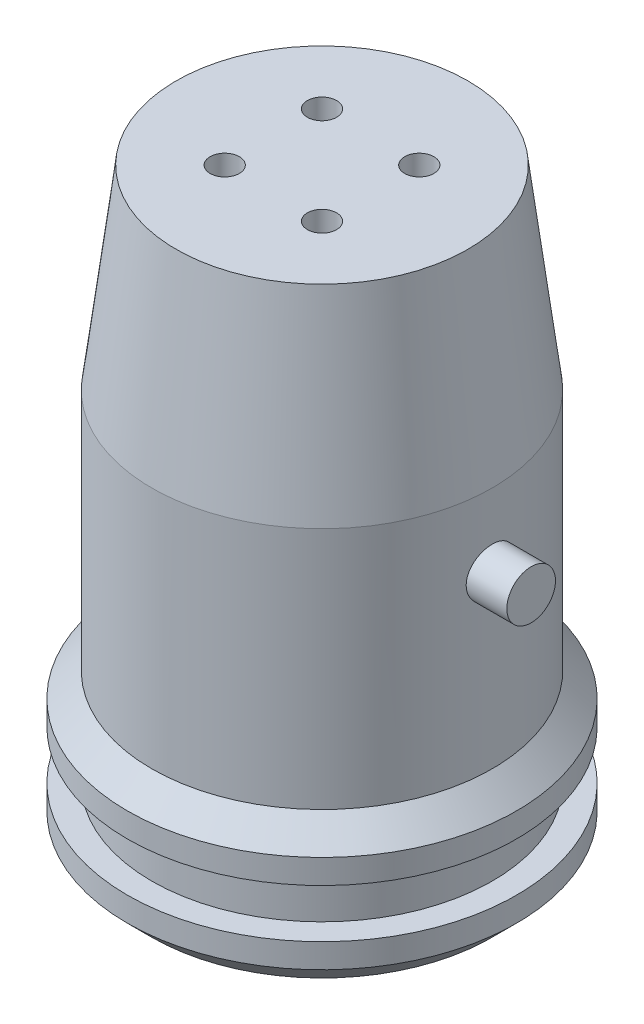
ISO-10303-21;
HEADER;
FILE_DESCRIPTION(('STEP AP214'),'2;1');
FILE_NAME('part.step','',(''),(''),'','','');
FILE_SCHEMA(('AUTOMOTIVE_DESIGN { 1 0 10303 214 1 1 1 1 }'));
ENDSEC;
DATA;
#1=APPLICATION_CONTEXT('core data for automotive mechanical design processes');
#2=APPLICATION_PROTOCOL_DEFINITION('international standard','automotive_design',2000,#1);
#3=PRODUCT_CONTEXT('',#1,'mechanical');
#4=PRODUCT('Part','Part','',(#3));
#5=PRODUCT_RELATED_PRODUCT_CATEGORY('part','',(#4));
#6=PRODUCT_DEFINITION_FORMATION('','',#4);
#7=PRODUCT_DEFINITION_CONTEXT('part definition',#1,'design');
#8=PRODUCT_DEFINITION('design','',#6,#7);
#9=PRODUCT_DEFINITION_SHAPE('','',#8);
#10=(LENGTH_UNIT() NAMED_UNIT(*) SI_UNIT(.MILLI.,.METRE.));
#11=(NAMED_UNIT(*) PLANE_ANGLE_UNIT() SI_UNIT($,.RADIAN.));
#12=(NAMED_UNIT(*) SI_UNIT($,.STERADIAN.) SOLID_ANGLE_UNIT());
#13=UNCERTAINTY_MEASURE_WITH_UNIT(LENGTH_MEASURE(1.E-05),#10,'distance_accuracy_value','');
#14=(GEOMETRIC_REPRESENTATION_CONTEXT(3) GLOBAL_UNCERTAINTY_ASSIGNED_CONTEXT((#13)) GLOBAL_UNIT_ASSIGNED_CONTEXT((#10,
#11,#12)) REPRESENTATION_CONTEXT('',''));
#15=CARTESIAN_POINT('',(0.,0.,0.));
#16=DIRECTION('',(0.,0.,1.));
#17=DIRECTION('',(1.,0.,0.));
#18=AXIS2_PLACEMENT_3D('',#15,#16,#17);
#19=CARTESIAN_POINT('',(0.,0.,0.));
#20=DIRECTION('',(0.,-1.,0.));
#21=DIRECTION('',(0.,0.,-1.));
#22=AXIS2_PLACEMENT_3D('',#19,#20,#21);
#23=CYLINDRICAL_SURFACE('',#22,17.5);
#24=CARTESIAN_POINT('',(0.,5.,0.));
#25=DIRECTION('',(0.,1.,0.));
#26=DIRECTION('',(0.,0.,1.));
#27=AXIS2_PLACEMENT_3D('',#24,#25,#26);
#28=CIRCLE('',#27,17.5);
#29=CARTESIAN_POINT('',(0.,5.,17.5));
#30=VERTEX_POINT('',#29);
#31=EDGE_CURVE('E77',#30,#30,#28,.F.);
#32=ORIENTED_EDGE('',*,*,#31,.F.);
#33=EDGE_LOOP('',(#32));
#34=FACE_BOUND('',#33,.T.);
#35=CARTESIAN_POINT('',(0.,10.,0.));
#36=DIRECTION('',(0.,1.,0.));
#37=DIRECTION('',(0.,0.,1.));
#38=AXIS2_PLACEMENT_3D('',#35,#36,#37);
#39=CIRCLE('',#38,17.5);
#40=CARTESIAN_POINT('',(0.,10.,17.5));
#41=VERTEX_POINT('',#40);
#42=EDGE_CURVE('E241',#41,#41,#39,.T.);
#43=ORIENTED_EDGE('',*,*,#42,.F.);
#44=EDGE_LOOP('',(#43));
#45=FACE_BOUND('',#44,.T.);
#46=ADVANCED_FACE('F33',(#34,#45),#23,.T.);
#47=CARTESIAN_POINT('',(0.,0.,0.));
#48=DIRECTION('',(0.,-1.,0.));
#49=DIRECTION('',(0.,0.,-1.));
#50=AXIS2_PLACEMENT_3D('',#47,#48,#49);
#51=CYLINDRICAL_SURFACE('',#50,15.);
#52=DIRECTION('',(0.,-1.,0.));
#53=VECTOR('',#52,1.);
#54=CARTESIAN_POINT('',(-10.,0.,-11.1803398874989));
#55=LINE('',#54,#53);
#56=CARTESIAN_POINT('',(-10.,37.5,-11.1803398874989));
#57=VERTEX_POINT('',#56);
#58=CARTESIAN_POINT('',(-10.,27.5,-11.1803398874989));
#59=VERTEX_POINT('',#58);
#60=EDGE_CURVE('E84',#57,#59,#55,.T.);
#61=ORIENTED_EDGE('',*,*,#60,.F.);
#62=CARTESIAN_POINT('',(0.,37.5,0.));
#63=DIRECTION('',(0.,1.,0.));
#64=DIRECTION('',(-1.,0.,0.));
#65=AXIS2_PLACEMENT_3D('',#62,#63,#64);
#66=CIRCLE('',#65,15.);
#67=CARTESIAN_POINT('',(9.99999999999999,37.5,-11.180339887499));
#68=VERTEX_POINT('',#67);
#69=EDGE_CURVE('E263',#68,#57,#66,.T.);
#70=ORIENTED_EDGE('',*,*,#69,.F.);
#71=DIRECTION('',(0.,-1.,0.));
#72=VECTOR('',#71,1.);
#73=CARTESIAN_POINT('',(9.99999999999998,0.,-11.180339887499));
#74=LINE('',#73,#72);
#75=CARTESIAN_POINT('',(9.99999999999999,27.5,-11.180339887499));
#76=VERTEX_POINT('',#75);
#77=EDGE_CURVE('E265',#76,#68,#74,.F.);
#78=ORIENTED_EDGE('',*,*,#77,.F.);
#79=CARTESIAN_POINT('',(0.,27.5,0.));
#80=DIRECTION('',(0.,-1.,0.));
#81=DIRECTION('',(1.,0.,0.));
#82=AXIS2_PLACEMENT_3D('',#79,#80,#81);
#83=CIRCLE('',#82,15.);
#84=EDGE_CURVE('E267',#59,#76,#83,.T.);
#85=ORIENTED_EDGE('',*,*,#84,.F.);
#86=EDGE_LOOP('',(#61,#70,#78,#85));
#87=FACE_BOUND('',#86,.T.);
#88=CARTESIAN_POINT('',(0.,40.,0.));
#89=DIRECTION('',(0.,-1.,0.));
#90=DIRECTION('',(0.,0.,-1.));
#91=AXIS2_PLACEMENT_3D('',#88,#89,#90);
#92=CIRCLE('',#91,15.);
#93=CARTESIAN_POINT('',(0.,40.,-15.));
#94=VERTEX_POINT('',#93);
#95=EDGE_CURVE('E131',#94,#94,#92,.T.);
#96=ORIENTED_EDGE('',*,*,#95,.F.);
#97=EDGE_LOOP('',(#96));
#98=FACE_BOUND('',#97,.T.);
#99=CARTESIAN_POINT('',(0.,0.,0.));
#100=DIRECTION('',(0.,-1.,0.));
#101=DIRECTION('',(0.,0.,-1.));
#102=AXIS2_PLACEMENT_3D('',#99,#100,#101);
#103=CIRCLE('',#102,15.);
#104=CARTESIAN_POINT('',(0.,0.,-15.));
#105=VERTEX_POINT('',#104);
#106=EDGE_CURVE('E96',#105,#105,#103,.T.);
#107=ORIENTED_EDGE('',*,*,#106,.T.);
#108=EDGE_LOOP('',(#107));
#109=FACE_BOUND('',#108,.T.);
#110=CARTESIAN_POINT('',(14.790199457749,32.5,2.5));
#111=CARTESIAN_POINT('',(14.790201973666,32.3606242518382,2.49999439841983));
#112=CARTESIAN_POINT('',(14.7921909238523,32.2211723939285,2.48830516902829));
#113=CARTESIAN_POINT('',(14.7999245720004,31.9461814567368,2.44187742806638));
#114=CARTESIAN_POINT('',(14.8056727334637,31.8106461062419,2.40711766030861));
#115=CARTESIAN_POINT('',(14.8202560936731,31.5475077166584,2.3156295436705));
#116=CARTESIAN_POINT('',(14.8290887118401,31.4198981513378,2.25891955493199));
#117=CARTESIAN_POINT('',(14.8488427210228,31.1760190452822,2.12518649688947));
#118=CARTESIAN_POINT('',(14.8597638769423,31.0597482304227,2.04816571350133));
#119=CARTESIAN_POINT('',(14.8825847115588,30.8406871502554,1.87518752696655));
#120=CARTESIAN_POINT('',(14.8944921732794,30.7380248686138,1.77906904893234));
#121=CARTESIAN_POINT('',(14.9178748066858,30.5502066931382,1.57097200469528));
#122=CARTESIAN_POINT('',(14.9293499527174,30.4650518368846,1.45899249914998));
#123=CARTESIAN_POINT('',(14.9506573698271,30.3141854327807,1.22152286994836));
#124=CARTESIAN_POINT('',(14.9604794243234,30.2485929922682,1.09595608145671));
#125=CARTESIAN_POINT('',(14.9772873695709,30.1394789294694,0.835395621723871));
#126=CARTESIAN_POINT('',(14.9842734447266,30.0959558721151,0.700402564078191));
#127=CARTESIAN_POINT('',(14.994567347244,30.0326074650161,0.426143726344245));
#128=CARTESIAN_POINT('',(14.9979085311091,30.0125670839953,0.286928886679273));
#129=CARTESIAN_POINT('',(15.0006507934278,29.9960842458474,0.00707528552579785));
#130=CARTESIAN_POINT('',(15.0000521396931,29.9996401847528,-0.133563378528898));
#131=CARTESIAN_POINT('',(14.9950085843139,30.0300813515282,-0.410802185078876));
#132=CARTESIAN_POINT('',(14.990601836924,30.0567351634091,-0.547428530700141));
#133=CARTESIAN_POINT('',(14.9784797877164,30.1322510742465,-0.814241979611792));
#134=CARTESIAN_POINT('',(14.9707643851321,30.1811138495895,-0.944428886651505));
#135=CARTESIAN_POINT('',(14.9528269851196,30.2998906403153,-1.19535614778265));
#136=CARTESIAN_POINT('',(14.9425936732688,30.3699000120824,-1.31605052301905));
#137=CARTESIAN_POINT('',(14.920757380715,30.528912822635,-1.54406552984664));
#138=CARTESIAN_POINT('',(14.9091542891913,30.6179177987108,-1.65138507791588));
#139=CARTESIAN_POINT('',(14.885702682326,30.8136788066193,-1.85097127344667));
#140=CARTESIAN_POINT('',(14.8738528973104,30.920637094901,-1.94303950225321));
#141=CARTESIAN_POINT('',(14.8513795978481,31.1485870902158,-2.10795458844807));
#142=CARTESIAN_POINT('',(14.8407560947132,31.2695789266828,-2.18080126853242));
#143=CARTESIAN_POINT('',(14.8219375456182,31.5223916418775,-2.30524443448829));
#144=CARTESIAN_POINT('',(14.813745233026,31.6542244980921,-2.35681702727925));
#145=CARTESIAN_POINT('',(14.8007618868988,31.9248490723075,-2.43702987081562));
#146=CARTESIAN_POINT('',(14.7959705538832,32.0636401764324,-2.46567214076796));
#147=CARTESIAN_POINT('',(14.7903895942212,32.3424661561621,-2.49893188487927));
#148=CARTESIAN_POINT('',(14.7895528575867,32.4824663797021,-2.50383220791244));
#149=CARTESIAN_POINT('',(14.7918503478236,32.7612866716908,-2.49022270268246));
#150=CARTESIAN_POINT('',(14.7949844213185,32.900106785514,-2.47171377862467));
#151=CARTESIAN_POINT('',(14.8048268745502,33.1717277591909,-2.4120523349281));
#152=CARTESIAN_POINT('',(14.8115125191835,33.304561139878,-2.37104379064639));
#153=CARTESIAN_POINT('',(14.827685730055,33.5614701662795,-2.26769819019228));
#154=CARTESIAN_POINT('',(14.8371734639058,33.6855452875509,-2.20535985810094));
#155=CARTESIAN_POINT('',(14.8579912839739,33.9226745944061,-2.06045667322923));
#156=CARTESIAN_POINT('',(14.8693375560035,34.0356165727561,-1.97771056415937));
#157=CARTESIAN_POINT('',(14.8925466667987,34.246113532695,-1.79458946570799));
#158=CARTESIAN_POINT('',(14.9044095418533,34.3436674311097,-1.69421323638405));
#159=CARTESIAN_POINT('',(14.9274642211826,34.5216518927287,-1.47742807032881));
#160=CARTESIAN_POINT('',(14.9386477634467,34.6018938262845,-1.3608632533862));
#161=CARTESIAN_POINT('',(14.9589511243294,34.7416553270049,-1.11574344794933));
#162=CARTESIAN_POINT('',(14.9680710096998,34.8011755644739,-0.98718884747063));
#163=CARTESIAN_POINT('',(14.9831835816958,34.8975105839549,-0.722299051501331));
#164=CARTESIAN_POINT('',(14.9891898456762,34.9344240757349,-0.586000562602614));
#165=CARTESIAN_POINT('',(14.9974558316928,34.9848155989638,-0.309030734874213));
#166=CARTESIAN_POINT('',(14.9997158620019,34.9982955587324,-0.168359756821622));
#167=CARTESIAN_POINT('',(15.0002303788781,35.0013818823122,0.111541275773676));
#168=CARTESIAN_POINT('',(14.9985330202419,34.9912752539411,0.250768160602665));
#169=CARTESIAN_POINT('',(14.9914217838733,34.9480960777306,0.525511974314706));
#170=CARTESIAN_POINT('',(14.9860079269518,34.9150236584903,0.66102892396748));
#171=CARTESIAN_POINT('',(14.972069888274,34.8269618344564,0.924396445918539));
#172=CARTESIAN_POINT('',(14.9635491704088,34.77199683179,1.05225537215382));
#173=CARTESIAN_POINT('',(14.9443275687803,34.6417420637694,1.29698045298217));
#174=CARTESIAN_POINT('',(14.9336265816741,34.5664513349376,1.41384608611822));
#175=CARTESIAN_POINT('',(14.9110762961641,34.3966649075395,1.6347129455264));
#176=CARTESIAN_POINT('',(14.8992152454112,34.3019590452488,1.73855143060275));
#177=CARTESIAN_POINT('',(14.8757630331437,34.0964716920962,1.92896387595091));
#178=CARTESIAN_POINT('',(14.8641719354951,33.9856864410875,2.0155337867119));
#179=CARTESIAN_POINT('',(14.8424834353391,33.7502546775104,2.16951427091087));
#180=CARTESIAN_POINT('',(14.8323971784578,33.6255156602345,2.2367849890577));
#181=CARTESIAN_POINT('',(14.8149921009131,33.3663907641619,2.34931453640427));
#182=CARTESIAN_POINT('',(14.8076705172488,33.2320146773226,2.39459535522308));
#183=CARTESIAN_POINT('',(14.7982474485649,32.9975962305126,2.45202605312742));
#184=CARTESIAN_POINT('',(14.7952462341947,32.8989731920374,2.46998741767139));
#185=CARTESIAN_POINT('',(14.7912213528807,32.7002465151631,2.49397629518132));
#186=CARTESIAN_POINT('',(14.7901976500369,32.6001429036758,2.50000402479278));
#187=CARTESIAN_POINT('',(14.790199457749,32.5,2.5));
#188=B_SPLINE_CURVE_WITH_KNOTS('',3,(#110,#111,#112,#113,#114,#115,#116,#117,#118,#119,#120,
#121,#122,#123,#124,#125,#126,#127,#128,#129,#130,#131,#132,#133,#134,#135,#136,#137,#138,#139,
#140,#141,#142,#143,#144,#145,#146,#147,#148,#149,#150,#151,#152,#153,#154,#155,#156,#157,#158,
#159,#160,#161,#162,#163,#164,#165,#166,#167,#168,#169,#170,#171,#172,#173,#174,#175,#176,#177,
#178,#179,#180,#181,#182,#183,#184,#185,#186,#187),.UNSPECIFIED.,.T.,.F.,(4,2,2,2,2,2,2,2,2,2,2,
2,2,2,2,2,2,2,2,2,2,2,2,2,2,2,2,2,2,2,2,2,2,2,2,2,2,2,4),(0.,0.417761038927743,0.83590751996297,
1.25370499787519,1.67145547405274,2.09289159155715,2.51435267834447,2.93832980111435,
3.36227935111113,3.78231567472566,4.20232344652693,4.61817121164669,5.03403164249534,
5.45179604139426,5.86959426226765,6.29246123462125,6.7153321074602,7.13867662498605,
7.56198385938079,7.98023542420412,8.39847083413977,8.81406064635492,9.22967532293576,
9.64912342762704,10.0686010443069,10.4924411303538,10.916267504767,11.3382298441765,
11.7601574591235,12.1769777626592,12.5937957321883,13.0101503983246,13.4265248039234,
13.8476699746325,14.2689137888181,14.6931372761832,15.1169356674446,15.4171067054377,
15.7172722940182),.UNSPECIFIED.);
#189=CARTESIAN_POINT('',(14.790199457749,32.5,2.5));
#190=VERTEX_POINT('',#189);
#191=EDGE_CURVE('E104',#190,#190,#188,.T.);
#192=ORIENTED_EDGE('',*,*,#191,.T.);
#193=EDGE_LOOP('',(#192));
#194=FACE_BOUND('',#193,.T.);
#195=ADVANCED_FACE('F135',(#87,#98,#109,#194),#51,.F.);
#196=CARTESIAN_POINT('',(15.,0.,0.));
#197=DIRECTION('',(0.,-1.,0.));
#198=DIRECTION('',(0.,0.,-1.));
#199=AXIS2_PLACEMENT_3D('',#196,#197,#198);
#200=PLANE('',#199);
#201=CARTESIAN_POINT('',(0.,0.,0.));
#202=DIRECTION('',(0.,-1.,0.));
#203=DIRECTION('',(0.,0.,-1.));
#204=AXIS2_PLACEMENT_3D('',#201,#202,#203);
#205=CIRCLE('',#204,17.5);
#206=CARTESIAN_POINT('',(0.,0.,-17.5));
#207=VERTEX_POINT('',#206);
#208=EDGE_CURVE('E212',#207,#207,#205,.T.);
#209=ORIENTED_EDGE('',*,*,#208,.T.);
#210=EDGE_LOOP('',(#209));
#211=FACE_BOUND('',#210,.T.);
#212=ORIENTED_EDGE('',*,*,#106,.F.);
#213=EDGE_LOOP('',(#212));
#214=FACE_BOUND('',#213,.T.);
#215=ADVANCED_FACE('F138',(#211,#214),#200,.T.);
#216=CARTESIAN_POINT('',(12.875,57.,0.));
#217=DIRECTION('',(0.,-1.,0.));
#218=DIRECTION('',(0.,0.,-1.));
#219=AXIS2_PLACEMENT_3D('',#216,#217,#218);
#220=PLANE('',#219);
#221=CARTESIAN_POINT('',(-5.00000000000005,57.,4.99999999999995));
#222=DIRECTION('',(0.,-1.,0.));
#223=DIRECTION('',(0.,0.,-1.));
#224=AXIS2_PLACEMENT_3D('',#221,#222,#223);
#225=CIRCLE('',#224,1.5);
#226=CARTESIAN_POINT('',(-5.00000000000005,57.,3.49999999999995));
#227=VERTEX_POINT('',#226);
#228=EDGE_CURVE('E189',#227,#227,#225,.T.);
#229=ORIENTED_EDGE('',*,*,#228,.F.);
#230=EDGE_LOOP('',(#229));
#231=FACE_BOUND('',#230,.T.);
#232=CARTESIAN_POINT('',(5.,57.,5.));
#233=DIRECTION('',(0.,-1.,0.));
#234=DIRECTION('',(0.,0.,-1.));
#235=AXIS2_PLACEMENT_3D('',#232,#233,#234);
#236=CIRCLE('',#235,1.5);
#237=CARTESIAN_POINT('',(5.,57.,3.5));
#238=VERTEX_POINT('',#237);
#239=EDGE_CURVE('E193',#238,#238,#236,.T.);
#240=ORIENTED_EDGE('',*,*,#239,.F.);
#241=EDGE_LOOP('',(#240));
#242=FACE_BOUND('',#241,.T.);
#243=CARTESIAN_POINT('',(5.00000000000002,57.,-4.99999999999998));
#244=DIRECTION('',(0.,-1.,0.));
#245=DIRECTION('',(0.,0.,-1.));
#246=AXIS2_PLACEMENT_3D('',#243,#244,#245);
#247=CIRCLE('',#246,1.5);
#248=CARTESIAN_POINT('',(5.00000000000002,57.,-6.49999999999998));
#249=VERTEX_POINT('',#248);
#250=EDGE_CURVE('E197',#249,#249,#247,.T.);
#251=ORIENTED_EDGE('',*,*,#250,.F.);
#252=EDGE_LOOP('',(#251));
#253=FACE_BOUND('',#252,.T.);
#254=CARTESIAN_POINT('',(-5.,57.,-5.));
#255=DIRECTION('',(0.,-1.,0.));
#256=DIRECTION('',(0.,0.,-1.));
#257=AXIS2_PLACEMENT_3D('',#254,#255,#256);
#258=CIRCLE('',#257,1.5);
#259=CARTESIAN_POINT('',(-5.,57.,-6.5));
#260=VERTEX_POINT('',#259);
#261=EDGE_CURVE('E201',#260,#260,#258,.T.);
#262=ORIENTED_EDGE('',*,*,#261,.F.);
#263=EDGE_LOOP('',(#262));
#264=FACE_BOUND('',#263,.T.);
#265=CARTESIAN_POINT('',(0.,57.,0.));
#266=DIRECTION('',(0.,-1.,0.));
#267=DIRECTION('',(0.,0.,-1.));
#268=AXIS2_PLACEMENT_3D('',#265,#266,#267);
#269=CIRCLE('',#268,12.875);
#270=CARTESIAN_POINT('',(0.,57.,-12.875));
#271=VERTEX_POINT('',#270);
#272=EDGE_CURVE('E204',#271,#271,#269,.T.);
#273=ORIENTED_EDGE('',*,*,#272,.T.);
#274=EDGE_LOOP('',(#273));
#275=FACE_BOUND('',#274,.T.);
#276=ADVANCED_FACE('F177',(#231,#242,#253,#264,#275),#220,.T.);
#277=CARTESIAN_POINT('',(0.,57.,0.));
#278=DIRECTION('',(0.,-1.,0.));
#279=DIRECTION('',(0.,0.,-1.));
#280=AXIS2_PLACEMENT_3D('',#277,#278,#279);
#281=CONICAL_SURFACE('',#280,12.875,0.124354994546761);
#282=ORIENTED_EDGE('',*,*,#95,.T.);
#283=EDGE_LOOP('',(#282));
#284=FACE_BOUND('',#283,.T.);
#285=ORIENTED_EDGE('',*,*,#272,.F.);
#286=EDGE_LOOP('',(#285));
#287=FACE_BOUND('',#286,.T.);
#288=ADVANCED_FACE('F121',(#284,#287),#281,.F.);
#289=CARTESIAN_POINT('',(21.5,32.5,0.));
#290=DIRECTION('',(-1.,0.,0.));
#291=DIRECTION('',(0.,0.,1.));
#292=AXIS2_PLACEMENT_3D('',#289,#290,#291);
#293=CYLINDRICAL_SURFACE('',#292,2.5);
#294=ORIENTED_EDGE('',*,*,#191,.F.);
#295=EDGE_LOOP('',(#294));
#296=FACE_BOUND('',#295,.T.);
#297=CARTESIAN_POINT('',(14.,32.5,0.));
#298=DIRECTION('',(1.,0.,0.));
#299=DIRECTION('',(0.,0.,-1.));
#300=AXIS2_PLACEMENT_3D('',#297,#298,#299);
#301=CIRCLE('',#300,2.5);
#302=CARTESIAN_POINT('',(14.,32.5,-2.5));
#303=VERTEX_POINT('',#302);
#304=EDGE_CURVE('E132',#303,#303,#301,.T.);
#305=ORIENTED_EDGE('',*,*,#304,.T.);
#306=EDGE_LOOP('',(#305));
#307=FACE_BOUND('',#306,.T.);
#308=ADVANCED_FACE('F118',(#296,#307),#293,.T.);
#309=CARTESIAN_POINT('',(14.,32.5,0.));
#310=DIRECTION('',(1.,0.,0.));
#311=DIRECTION('',(0.,0.,-1.));
#312=AXIS2_PLACEMENT_3D('',#309,#310,#311);
#313=PLANE('',#312);
#314=ORIENTED_EDGE('',*,*,#304,.F.);
#315=EDGE_LOOP('',(#314));
#316=FACE_BOUND('',#315,.T.);
#317=ADVANCED_FACE('F119',(#316),#313,.F.);
#318=CARTESIAN_POINT('',(0.,2.5,0.));
#319=DIRECTION('',(0.,1.,0.));
#320=DIRECTION('',(0.,0.,1.));
#321=AXIS2_PLACEMENT_3D('',#318,#319,#320);
#322=CYLINDRICAL_SURFACE('',#321,20.);
#323=CARTESIAN_POINT('',(0.,2.5,0.));
#324=DIRECTION('',(0.,1.,0.));
#325=DIRECTION('',(0.,0.,1.));
#326=AXIS2_PLACEMENT_3D('',#323,#324,#325);
#327=CIRCLE('',#326,20.);
#328=CARTESIAN_POINT('',(0.,2.5,20.));
#329=VERTEX_POINT('',#328);
#330=EDGE_CURVE('E227',#329,#329,#327,.T.);
#331=ORIENTED_EDGE('',*,*,#330,.T.);
#332=EDGE_LOOP('',(#331));
#333=FACE_BOUND('',#332,.T.);
#334=CARTESIAN_POINT('',(0.,5.,0.));
#335=DIRECTION('',(0.,1.,0.));
#336=DIRECTION('',(0.,0.,1.));
#337=AXIS2_PLACEMENT_3D('',#334,#335,#336);
#338=CIRCLE('',#337,20.);
#339=CARTESIAN_POINT('',(0.,5.,20.));
#340=VERTEX_POINT('',#339);
#341=EDGE_CURVE('E230',#340,#340,#338,.T.);
#342=ORIENTED_EDGE('',*,*,#341,.F.);
#343=EDGE_LOOP('',(#342));
#344=FACE_BOUND('',#343,.T.);
#345=ADVANCED_FACE('F312',(#333,#344),#322,.T.);
#346=CARTESIAN_POINT('',(0.,5.,0.));
#347=DIRECTION('',(0.,1.,0.));
#348=DIRECTION('',(0.,0.,1.));
#349=AXIS2_PLACEMENT_3D('',#346,#347,#348);
#350=PLANE('',#349);
#351=ORIENTED_EDGE('',*,*,#31,.T.);
#352=EDGE_LOOP('',(#351));
#353=FACE_BOUND('',#352,.T.);
#354=ORIENTED_EDGE('',*,*,#341,.T.);
#355=EDGE_LOOP('',(#354));
#356=FACE_BOUND('',#355,.T.);
#357=ADVANCED_FACE('F305',(#353,#356),#350,.T.);
#358=CARTESIAN_POINT('',(0.,10.,0.));
#359=DIRECTION('',(0.,1.,0.));
#360=DIRECTION('',(0.,0.,1.));
#361=AXIS2_PLACEMENT_3D('',#358,#359,#360);
#362=PLANE('',#361);
#363=CARTESIAN_POINT('',(0.,10.,0.));
#364=DIRECTION('',(0.,1.,0.));
#365=DIRECTION('',(0.,0.,1.));
#366=AXIS2_PLACEMENT_3D('',#363,#364,#365);
#367=CIRCLE('',#366,20.);
#368=CARTESIAN_POINT('',(0.,10.,20.));
#369=VERTEX_POINT('',#368);
#370=EDGE_CURVE('E238',#369,#369,#367,.T.);
#371=ORIENTED_EDGE('',*,*,#370,.F.);
#372=EDGE_LOOP('',(#371));
#373=FACE_BOUND('',#372,.T.);
#374=ORIENTED_EDGE('',*,*,#42,.T.);
#375=EDGE_LOOP('',(#374));
#376=FACE_BOUND('',#375,.T.);
#377=ADVANCED_FACE('F301',(#373,#376),#362,.F.);
#378=CARTESIAN_POINT('',(0.,12.5,0.));
#379=DIRECTION('',(0.,-1.,0.));
#380=DIRECTION('',(0.,0.,-1.));
#381=AXIS2_PLACEMENT_3D('',#378,#379,#380);
#382=CYLINDRICAL_SURFACE('',#381,20.);
#383=CARTESIAN_POINT('',(0.,12.5,0.));
#384=DIRECTION('',(0.,1.,0.));
#385=DIRECTION('',(0.,0.,1.));
#386=AXIS2_PLACEMENT_3D('',#383,#384,#385);
#387=CIRCLE('',#386,20.);
#388=CARTESIAN_POINT('',(0.,12.5,20.));
#389=VERTEX_POINT('',#388);
#390=EDGE_CURVE('E235',#389,#389,#387,.T.);
#391=ORIENTED_EDGE('',*,*,#390,.F.);
#392=EDGE_LOOP('',(#391));
#393=FACE_BOUND('',#392,.T.);
#394=ORIENTED_EDGE('',*,*,#370,.T.);
#395=EDGE_LOOP('',(#394));
#396=FACE_BOUND('',#395,.T.);
#397=ADVANCED_FACE('F304',(#393,#396),#382,.T.);
#398=CARTESIAN_POINT('',(21.5,32.5,0.));
#399=DIRECTION('',(1.,0.,0.));
#400=DIRECTION('',(0.,0.,-1.));
#401=AXIS2_PLACEMENT_3D('',#398,#399,#400);
#402=PLANE('',#401);
#403=CARTESIAN_POINT('',(21.5,32.5,0.));
#404=DIRECTION('',(1.,0.,0.));
#405=DIRECTION('',(0.,0.,-1.));
#406=AXIS2_PLACEMENT_3D('',#403,#404,#405);
#407=CIRCLE('',#406,2.5);
#408=CARTESIAN_POINT('',(21.5,32.5,-2.5));
#409=VERTEX_POINT('',#408);
#410=EDGE_CURVE('E105',#409,#409,#407,.T.);
#411=ORIENTED_EDGE('',*,*,#410,.T.);
#412=EDGE_LOOP('',(#411));
#413=FACE_BOUND('',#412,.T.);
#414=ADVANCED_FACE('F175',(#413),#402,.T.);
#415=CARTESIAN_POINT('',(0.,60.,0.));
#416=DIRECTION('',(0.,1.,0.));
#417=DIRECTION('',(0.,0.,1.));
#418=AXIS2_PLACEMENT_3D('',#415,#416,#417);
#419=PLANE('',#418);
#420=CARTESIAN_POINT('',(-5.00000000000005,60.,4.99999999999995));
#421=DIRECTION('',(0.,1.,0.));
#422=DIRECTION('',(1.,0.,0.));
#423=AXIS2_PLACEMENT_3D('',#420,#421,#422);
#424=CIRCLE('',#423,1.5);
#425=CARTESIAN_POINT('',(-3.50000000000005,60.,4.99999999999996));
#426=VERTEX_POINT('',#425);
#427=EDGE_CURVE('E259',#426,#426,#424,.T.);
#428=ORIENTED_EDGE('',*,*,#427,.F.);
#429=EDGE_LOOP('',(#428));
#430=FACE_BOUND('',#429,.T.);
#431=CARTESIAN_POINT('',(5.,60.,5.));
#432=DIRECTION('',(0.,1.,0.));
#433=DIRECTION('',(0.,0.,-1.));
#434=AXIS2_PLACEMENT_3D('',#431,#432,#433);
#435=CIRCLE('',#434,1.5);
#436=CARTESIAN_POINT('',(5.,60.,3.5));
#437=VERTEX_POINT('',#436);
#438=EDGE_CURVE('E255',#437,#437,#435,.T.);
#439=ORIENTED_EDGE('',*,*,#438,.F.);
#440=EDGE_LOOP('',(#439));
#441=FACE_BOUND('',#440,.T.);
#442=CARTESIAN_POINT('',(5.00000000000002,60.,-4.99999999999998));
#443=DIRECTION('',(0.,1.,0.));
#444=DIRECTION('',(-1.,0.,0.));
#445=AXIS2_PLACEMENT_3D('',#442,#443,#444);
#446=CIRCLE('',#445,1.5);
#447=CARTESIAN_POINT('',(3.50000000000002,60.,-4.99999999999999));
#448=VERTEX_POINT('',#447);
#449=EDGE_CURVE('E251',#448,#448,#446,.T.);
#450=ORIENTED_EDGE('',*,*,#449,.F.);
#451=EDGE_LOOP('',(#450));
#452=FACE_BOUND('',#451,.T.);
#453=CARTESIAN_POINT('',(-5.,60.,-5.));
#454=DIRECTION('',(0.,1.,0.));
#455=DIRECTION('',(0.,0.,1.));
#456=AXIS2_PLACEMENT_3D('',#453,#454,#455);
#457=CIRCLE('',#456,1.5);
#458=CARTESIAN_POINT('',(-5.,60.,-3.5));
#459=VERTEX_POINT('',#458);
#460=EDGE_CURVE('E247',#459,#459,#457,.T.);
#461=ORIENTED_EDGE('',*,*,#460,.F.);
#462=EDGE_LOOP('',(#461));
#463=FACE_BOUND('',#462,.T.);
#464=CARTESIAN_POINT('',(0.,60.,0.));
#465=DIRECTION('',(0.,-1.,0.));
#466=DIRECTION('',(0.,0.,-1.));
#467=AXIS2_PLACEMENT_3D('',#464,#465,#466);
#468=CIRCLE('',#467,15.);
#469=CARTESIAN_POINT('',(0.,60.,-15.));
#470=VERTEX_POINT('',#469);
#471=EDGE_CURVE('E206',#470,#470,#468,.T.);
#472=ORIENTED_EDGE('',*,*,#471,.F.);
#473=EDGE_LOOP('',(#472));
#474=FACE_BOUND('',#473,.T.);
#475=ADVANCED_FACE('F116',(#430,#441,#452,#463,#474),#419,.T.);
#476=CARTESIAN_POINT('',(17.3205080756888,32.5,2.5));
#477=CARTESIAN_POINT('',(17.3205103214296,32.6396552140505,2.49999417644981));
#478=CARTESIAN_POINT('',(17.3222153996634,32.7793933909654,2.48825830633601));
#479=CARTESIAN_POINT('',(17.3288474891277,33.0549682955289,2.44163425172347));
#480=CARTESIAN_POINT('',(17.3337777110364,33.1908009943939,2.40672299527129));
#481=CARTESIAN_POINT('',(17.346290533042,33.4545358750361,2.31480923545587));
#482=CARTESIAN_POINT('',(17.3538711688453,33.5824438476257,2.257823089026));
#483=CARTESIAN_POINT('',(17.3708283324759,33.8268621618351,2.12341469861514));
#484=CARTESIAN_POINT('',(17.3802045949313,33.9433741838004,2.04599547375906));
#485=CARTESIAN_POINT('',(17.3997728156945,34.1625603698092,1.87231683550246));
#486=CARTESIAN_POINT('',(17.4099696809091,34.2651396423324,1.77593820534162));
#487=CARTESIAN_POINT('',(17.4299862889805,34.4527269465507,1.56733384870894));
#488=CARTESIAN_POINT('',(17.4398060116945,34.5377340408003,1.45510727731391));
#489=CARTESIAN_POINT('',(17.4580129627861,34.6881113721996,1.21738798002562));
#490=CARTESIAN_POINT('',(17.4663937786684,34.753394643148,1.09183970777012));
#491=CARTESIAN_POINT('',(17.4807243931613,34.8619134191598,0.83142093245387));
#492=CARTESIAN_POINT('',(17.4866743085456,34.9051499833093,0.696550877549161));
#493=CARTESIAN_POINT('',(17.4954381251123,34.9680615087053,0.422292579426188));
#494=CARTESIAN_POINT('',(17.4982731289764,34.9878950874578,0.282941406337346));
#495=CARTESIAN_POINT('',(17.5005599435479,35.0039298732083,0.00286195659799675));
#496=CARTESIAN_POINT('',(17.5000119256529,35.0001322774576,-0.137866249925726));
#497=CARTESIAN_POINT('',(17.4956113682908,34.9691382772302,-0.415623740232339));
#498=CARTESIAN_POINT('',(17.4917829266554,34.9421125013969,-0.552672499713795));
#499=CARTESIAN_POINT('',(17.4812785676579,34.865696800376,-0.82026949391087));
#500=CARTESIAN_POINT('',(17.4746025826336,34.8163063437653,-0.950817574077357));
#501=CARTESIAN_POINT('',(17.4591117546373,34.6963865690205,-1.20222745845968));
#502=CARTESIAN_POINT('',(17.4502896021464,34.6257848111014,-1.32305424098884));
#503=CARTESIAN_POINT('',(17.4314908337029,34.4654993840747,-1.55120977517206));
#504=CARTESIAN_POINT('',(17.4215141487494,34.375814574196,-1.65853771926479));
#505=CARTESIAN_POINT('',(17.4014150617975,34.178956747905,-1.85765373882983));
#506=CARTESIAN_POINT('',(17.3912921538904,34.0716348340635,-1.9492946166523));
#507=CARTESIAN_POINT('',(17.3721286734458,33.8430568482131,-2.11328736987655));
#508=CARTESIAN_POINT('',(17.3630881064538,33.721800704818,-2.18563914645224));
#509=CARTESIAN_POINT('',(17.3471131710366,33.4686496376173,-2.30901626900994));
#510=CARTESIAN_POINT('',(17.3401801971233,33.3367477426468,-2.36002750314723));
#511=CARTESIAN_POINT('',(17.3292308226119,33.0661280252176,-2.43913279635401));
#512=CARTESIAN_POINT('',(17.3252142364516,32.9274106370105,-2.46722831350379));
#513=CARTESIAN_POINT('',(17.3205872594665,32.6484043282125,-2.49950488360243));
#514=CARTESIAN_POINT('',(17.3199472150388,32.5081399675055,-2.5038941388059));
#515=CARTESIAN_POINT('',(17.3220671566589,32.2288777437186,-2.48918510308901));
#516=CARTESIAN_POINT('',(17.3248270473289,32.0898798452209,-2.47008747104213));
#517=CARTESIAN_POINT('',(17.3334087065645,31.8177347749644,-2.40912297319002));
#518=CARTESIAN_POINT('',(17.3392166418156,31.6845640911683,-2.36735894805526));
#519=CARTESIAN_POINT('',(17.3532286401521,31.4271140031794,-2.2623538271433));
#520=CARTESIAN_POINT('',(17.3614328113701,31.3028350005478,-2.19911176212677));
#521=CARTESIAN_POINT('',(17.3793831051677,31.0657601503481,-2.05244200414032));
#522=CARTESIAN_POINT('',(17.3891394056538,30.9530487984845,-1.96887900033906));
#523=CARTESIAN_POINT('',(17.4090636358241,30.7431753454681,-1.78412847276706));
#524=CARTESIAN_POINT('',(17.4192315865368,30.6460140399261,-1.68294004775271));
#525=CARTESIAN_POINT('',(17.4389256551739,30.4692559769578,-1.46489635785669));
#526=CARTESIAN_POINT('',(17.4484463695232,30.3897968471006,-1.34792896515541));
#527=CARTESIAN_POINT('',(17.4656902694975,30.2516555460803,-1.10218588096399));
#528=CARTESIAN_POINT('',(17.4734135005061,30.1929728503276,-0.973410487720567));
#529=CARTESIAN_POINT('',(17.4861684730555,30.0982723571054,-0.708144905742412));
#530=CARTESIAN_POINT('',(17.4912092957152,30.0621780142156,-0.571682498904908));
#531=CARTESIAN_POINT('',(17.4980694889566,30.0134306661167,-0.294556573807227));
#532=CARTESIAN_POINT('',(17.4998890516906,30.0007762626827,-0.153893306642841));
#533=CARTESIAN_POINT('',(17.5001000958988,29.9992997013194,0.126303913283946));
#534=CARTESIAN_POINT('',(17.4985219377795,30.0102664762269,0.265836777188222));
#535=CARTESIAN_POINT('',(17.4921758034385,30.0552701875538,0.541053291849853));
#536=CARTESIAN_POINT('',(17.4874078347479,30.0893070695049,0.676736951694345));
#537=CARTESIAN_POINT('',(17.4752152756766,30.1794124717852,0.940354643121529));
#538=CARTESIAN_POINT('',(17.4677922852398,30.2354677256056,1.06829328775859));
#539=CARTESIAN_POINT('',(17.4511070012847,30.3679964365028,1.3129821323145));
#540=CARTESIAN_POINT('',(17.4418446593271,30.4444704313238,1.42973203745874));
#541=CARTESIAN_POINT('',(17.4224130932707,30.6164346440281,1.64980243700277));
#542=CARTESIAN_POINT('',(17.4122368231533,30.7120811335364,1.75300020789777));
#543=CARTESIAN_POINT('',(17.3921777929122,30.9193469502984,1.94195895909259));
#544=CARTESIAN_POINT('',(17.3822951023791,31.0309700287615,2.02771583289179));
#545=CARTESIAN_POINT('',(17.3638885978291,31.267681797906,2.17974404343878));
#546=CARTESIAN_POINT('',(17.3553719241531,31.3928358629594,2.24591442873638));
#547=CARTESIAN_POINT('',(17.3407453505435,31.6525403707009,2.35619878131274));
#548=CARTESIAN_POINT('',(17.3346329177213,31.7870807478825,2.40033597402074));
#549=CARTESIAN_POINT('',(17.3269411528971,32.0185455322955,2.4551156895733));
#550=CARTESIAN_POINT('',(17.3245412999151,32.1140304192652,2.47192203162013));
#551=CARTESIAN_POINT('',(17.3213239914062,32.3063302462053,2.49436614385582));
#552=CARTESIAN_POINT('',(17.3205065182042,32.403145171307,2.50000403879627));
#553=CARTESIAN_POINT('',(17.3205080756888,32.5,2.5));
#554=B_SPLINE_CURVE_WITH_KNOTS('',3,(#476,#477,#478,#479,#480,#481,#482,#483,#484,#485,#486,
#487,#488,#489,#490,#491,#492,#493,#494,#495,#496,#497,#498,#499,#500,#501,#502,#503,#504,#505,
#506,#507,#508,#509,#510,#511,#512,#513,#514,#515,#516,#517,#518,#519,#520,#521,#522,#523,#524,
#525,#526,#527,#528,#529,#530,#531,#532,#533,#534,#535,#536,#537,#538,#539,#540,#541,#542,#543,
#544,#545,#546,#547,#548,#549,#550,#551,#552,#553),.UNSPECIFIED.,.T.,.F.,(4,2,2,2,2,2,2,2,2,2,2,
2,2,2,2,2,2,2,2,2,2,2,2,2,2,2,2,2,2,2,2,2,2,2,2,2,2,2,4),(0.,0.418611686761221,
0.837640743157853,1.25635990174197,1.67501722635385,2.09639644561274,2.51779813893172,
2.94103163345005,3.36424479463776,3.78457277673273,4.20487946347625,4.62212481134303,
5.0393800741964,5.45807684551735,5.876798653263,6.29925647482805,6.72171646077848,
7.14445536663838,7.56716737238595,7.98616076353201,8.40514240099883,8.82223876005374,
9.23935394391407,9.65932651264331,10.0793205622075,10.5024740190271,10.9256167907707,
11.3473177767364,11.7689936068438,12.1869171913008,12.6048397890488,13.0225109653891,
13.4401931425249,13.8614293663583,14.2827646567287,14.7062351939404,15.1292583986304,
15.4195806495844,15.7098996576199),.UNSPECIFIED.);
#555=CARTESIAN_POINT('',(17.3205080756888,32.5,2.5));
#556=VERTEX_POINT('',#555);
#557=EDGE_CURVE('E97',#556,#556,#554,.T.);
#558=ORIENTED_EDGE('',*,*,#557,.F.);
#559=EDGE_LOOP('',(#558));
#560=FACE_BOUND('',#559,.T.);
#561=ORIENTED_EDGE('',*,*,#410,.F.);
#562=EDGE_LOOP('',(#561));
#563=FACE_BOUND('',#562,.T.);
#564=ADVANCED_FACE('F110',(#560,#563),#293,.T.);
#565=CARTESIAN_POINT('',(0.,40.,0.));
#566=DIRECTION('',(0.,-1.,0.));
#567=DIRECTION('',(0.,0.,-1.));
#568=AXIS2_PLACEMENT_3D('',#565,#566,#567);
#569=CONICAL_SURFACE('',#568,17.5,0.124354994546761);
#570=ORIENTED_EDGE('',*,*,#471,.T.);
#571=EDGE_LOOP('',(#570));
#572=FACE_BOUND('',#571,.T.);
#573=CARTESIAN_POINT('',(0.,40.,0.));
#574=DIRECTION('',(0.,-1.,0.));
#575=DIRECTION('',(0.,0.,-1.));
#576=AXIS2_PLACEMENT_3D('',#573,#574,#575);
#577=CIRCLE('',#576,17.5);
#578=CARTESIAN_POINT('',(0.,40.,-17.5));
#579=VERTEX_POINT('',#578);
#580=EDGE_CURVE('E207',#579,#579,#577,.T.);
#581=ORIENTED_EDGE('',*,*,#580,.F.);
#582=EDGE_LOOP('',(#581));
#583=FACE_BOUND('',#582,.T.);
#584=ADVANCED_FACE('F115',(#572,#583),#569,.T.);
#585=CARTESIAN_POINT('',(0.,15.,0.));
#586=DIRECTION('',(0.,1.,0.));
#587=DIRECTION('',(0.,0.,1.));
#588=AXIS2_PLACEMENT_3D('',#585,#586,#587);
#589=CIRCLE('',#588,17.5);
#590=CARTESIAN_POINT('',(0.,15.,17.5));
#591=VERTEX_POINT('',#590);
#592=EDGE_CURVE('E11',#591,#591,#589,.T.);
#593=ORIENTED_EDGE('',*,*,#592,.T.);
#594=EDGE_LOOP('',(#593));
#595=FACE_BOUND('',#594,.T.);
#596=DIRECTION('',(0.,-1.,0.));
#597=VECTOR('',#596,1.);
#598=CARTESIAN_POINT('',(-10.,0.,-14.3614066163451));
#599=LINE('',#598,#597);
#600=CARTESIAN_POINT('',(-10.,27.5,-14.3614066163451));
#601=VERTEX_POINT('',#600);
#602=CARTESIAN_POINT('',(-10.,37.5,-14.3614066163451));
#603=VERTEX_POINT('',#602);
#604=EDGE_CURVE('E41',#601,#603,#599,.F.);
#605=ORIENTED_EDGE('',*,*,#604,.F.);
#606=CARTESIAN_POINT('',(0.,27.5,0.));
#607=DIRECTION('',(0.,-1.,0.));
#608=DIRECTION('',(1.,0.,0.));
#609=AXIS2_PLACEMENT_3D('',#606,#607,#608);
#610=CIRCLE('',#609,17.5);
#611=CARTESIAN_POINT('',(9.99999999999999,27.5,-14.3614066163451));
#612=VERTEX_POINT('',#611);
#613=EDGE_CURVE('E71',#612,#601,#610,.F.);
#614=ORIENTED_EDGE('',*,*,#613,.F.);
#615=DIRECTION('',(0.,-1.,0.));
#616=VECTOR('',#615,1.);
#617=CARTESIAN_POINT('',(9.99999999999998,0.,-14.3614066163451));
#618=LINE('',#617,#616);
#619=CARTESIAN_POINT('',(9.99999999999999,37.5,-14.3614066163451));
#620=VERTEX_POINT('',#619);
#621=EDGE_CURVE('E76',#620,#612,#618,.T.);
#622=ORIENTED_EDGE('',*,*,#621,.F.);
#623=CARTESIAN_POINT('',(0.,37.5,0.));
#624=DIRECTION('',(0.,1.,0.));
#625=DIRECTION('',(-1.,0.,0.));
#626=AXIS2_PLACEMENT_3D('',#623,#624,#625);
#627=CIRCLE('',#626,17.5);
#628=EDGE_CURVE('E90',#603,#620,#627,.F.);
#629=ORIENTED_EDGE('',*,*,#628,.F.);
#630=EDGE_LOOP('',(#605,#614,#622,#629));
#631=FACE_BOUND('',#630,.T.);
#632=ORIENTED_EDGE('',*,*,#580,.T.);
#633=EDGE_LOOP('',(#632));
#634=FACE_BOUND('',#633,.T.);
#635=ORIENTED_EDGE('',*,*,#557,.T.);
#636=EDGE_LOOP('',(#635));
#637=FACE_BOUND('',#636,.T.);
#638=ADVANCED_FACE('F88',(#595,#631,#634,#637),#23,.T.);
#639=CARTESIAN_POINT('',(-5.,0.,-5.));
#640=DIRECTION('',(0.,1.,0.));
#641=DIRECTION('',(0.,0.,1.));
#642=AXIS2_PLACEMENT_3D('',#639,#640,#641);
#643=CYLINDRICAL_SURFACE('',#642,1.5);
#644=ORIENTED_EDGE('',*,*,#261,.T.);
#645=EDGE_LOOP('',(#644));
#646=FACE_BOUND('',#645,.T.);
#647=ORIENTED_EDGE('',*,*,#460,.T.);
#648=EDGE_LOOP('',(#647));
#649=FACE_BOUND('',#648,.T.);
#650=ADVANCED_FACE('F159',(#646,#649),#643,.F.);
#651=CARTESIAN_POINT('',(5.00000000000002,0.,-4.99999999999998));
#652=DIRECTION('',(0.,1.,0.));
#653=DIRECTION('',(0.,0.,1.));
#654=AXIS2_PLACEMENT_3D('',#651,#652,#653);
#655=CYLINDRICAL_SURFACE('',#654,1.5);
#656=ORIENTED_EDGE('',*,*,#250,.T.);
#657=EDGE_LOOP('',(#656));
#658=FACE_BOUND('',#657,.T.);
#659=ORIENTED_EDGE('',*,*,#449,.T.);
#660=EDGE_LOOP('',(#659));
#661=FACE_BOUND('',#660,.T.);
#662=ADVANCED_FACE('F165',(#658,#661),#655,.F.);
#663=CARTESIAN_POINT('',(5.,0.,5.));
#664=DIRECTION('',(0.,1.,0.));
#665=DIRECTION('',(0.,0.,1.));
#666=AXIS2_PLACEMENT_3D('',#663,#664,#665);
#667=CYLINDRICAL_SURFACE('',#666,1.5);
#668=ORIENTED_EDGE('',*,*,#239,.T.);
#669=EDGE_LOOP('',(#668));
#670=FACE_BOUND('',#669,.T.);
#671=ORIENTED_EDGE('',*,*,#438,.T.);
#672=EDGE_LOOP('',(#671));
#673=FACE_BOUND('',#672,.T.);
#674=ADVANCED_FACE('F293',(#670,#673),#667,.F.);
#675=CARTESIAN_POINT('',(-5.00000000000005,0.,4.99999999999995));
#676=DIRECTION('',(0.,1.,0.));
#677=DIRECTION('',(0.,0.,1.));
#678=AXIS2_PLACEMENT_3D('',#675,#676,#677);
#679=CYLINDRICAL_SURFACE('',#678,1.5);
#680=ORIENTED_EDGE('',*,*,#228,.T.);
#681=EDGE_LOOP('',(#680));
#682=FACE_BOUND('',#681,.T.);
#683=ORIENTED_EDGE('',*,*,#427,.T.);
#684=EDGE_LOOP('',(#683));
#685=FACE_BOUND('',#684,.T.);
#686=ADVANCED_FACE('F288',(#682,#685),#679,.F.);
#687=CARTESIAN_POINT('',(-10.,37.5,-20.));
#688=DIRECTION('',(-1.,0.,0.));
#689=DIRECTION('',(0.,-1.,0.));
#690=AXIS2_PLACEMENT_3D('',#687,#688,#689);
#691=PLANE('',#690);
#692=ORIENTED_EDGE('',*,*,#60,.T.);
#693=DIRECTION('',(0.,0.,1.));
#694=VECTOR('',#693,1.);
#695=CARTESIAN_POINT('',(-10.,27.5,-20.));
#696=LINE('',#695,#694);
#697=EDGE_CURVE('E48',#601,#59,#696,.T.);
#698=ORIENTED_EDGE('',*,*,#697,.F.);
#699=ORIENTED_EDGE('',*,*,#604,.T.);
#700=DIRECTION('',(0.,0.,1.));
#701=VECTOR('',#700,1.);
#702=CARTESIAN_POINT('',(-10.,37.5,-20.));
#703=LINE('',#702,#701);
#704=EDGE_CURVE('E268',#603,#57,#703,.T.);
#705=ORIENTED_EDGE('',*,*,#704,.T.);
#706=EDGE_LOOP('',(#692,#698,#699,#705));
#707=FACE_BOUND('',#706,.T.);
#708=ADVANCED_FACE('F80',(#707),#691,.F.);
#709=CARTESIAN_POINT('',(-10.,37.5,-20.));
#710=DIRECTION('',(0.,1.,0.));
#711=DIRECTION('',(-1.,0.,0.));
#712=AXIS2_PLACEMENT_3D('',#709,#710,#711);
#713=PLANE('',#712);
#714=ORIENTED_EDGE('',*,*,#69,.T.);
#715=ORIENTED_EDGE('',*,*,#704,.F.);
#716=ORIENTED_EDGE('',*,*,#628,.T.);
#717=DIRECTION('',(0.,0.,1.));
#718=VECTOR('',#717,1.);
#719=CARTESIAN_POINT('',(9.99999999999999,37.5,-20.));
#720=LINE('',#719,#718);
#721=EDGE_CURVE('E271',#620,#68,#720,.T.);
#722=ORIENTED_EDGE('',*,*,#721,.T.);
#723=EDGE_LOOP('',(#714,#715,#716,#722));
#724=FACE_BOUND('',#723,.T.);
#725=ADVANCED_FACE('F280',(#724),#713,.F.);
#726=CARTESIAN_POINT('',(9.99999999999999,37.5,-20.));
#727=DIRECTION('',(1.,0.,0.));
#728=DIRECTION('',(0.,1.,0.));
#729=AXIS2_PLACEMENT_3D('',#726,#727,#728);
#730=PLANE('',#729);
#731=ORIENTED_EDGE('',*,*,#77,.T.);
#732=ORIENTED_EDGE('',*,*,#721,.F.);
#733=ORIENTED_EDGE('',*,*,#621,.T.);
#734=DIRECTION('',(0.,0.,1.));
#735=VECTOR('',#734,1.);
#736=CARTESIAN_POINT('',(9.99999999999999,27.5,-20.));
#737=LINE('',#736,#735);
#738=EDGE_CURVE('E53',#612,#76,#737,.T.);
#739=ORIENTED_EDGE('',*,*,#738,.T.);
#740=EDGE_LOOP('',(#731,#732,#733,#739));
#741=FACE_BOUND('',#740,.T.);
#742=ADVANCED_FACE('F148',(#741),#730,.F.);
#743=CARTESIAN_POINT('',(-10.,27.5,-20.));
#744=DIRECTION('',(0.,-1.,0.));
#745=DIRECTION('',(1.,0.,0.));
#746=AXIS2_PLACEMENT_3D('',#743,#744,#745);
#747=PLANE('',#746);
#748=ORIENTED_EDGE('',*,*,#84,.T.);
#749=ORIENTED_EDGE('',*,*,#738,.F.);
#750=ORIENTED_EDGE('',*,*,#613,.T.);
#751=ORIENTED_EDGE('',*,*,#697,.T.);
#752=EDGE_LOOP('',(#748,#749,#750,#751));
#753=FACE_BOUND('',#752,.T.);
#754=ADVANCED_FACE('F72',(#753),#747,.F.);
#755=CARTESIAN_POINT('',(0.,12.5,0.));
#756=DIRECTION('',(0.,-1.,0.));
#757=DIRECTION('',(0.,0.,-1.));
#758=AXIS2_PLACEMENT_3D('',#755,#756,#757);
#759=CONICAL_SURFACE('',#758,20.,0.785398163397454);
#760=ORIENTED_EDGE('',*,*,#592,.F.);
#761=EDGE_LOOP('',(#760));
#762=FACE_BOUND('',#761,.T.);
#763=ORIENTED_EDGE('',*,*,#390,.T.);
#764=EDGE_LOOP('',(#763));
#765=FACE_BOUND('',#764,.T.);
#766=ADVANCED_FACE('F140',(#762,#765),#759,.T.);
#767=CARTESIAN_POINT('',(0.,2.5,0.));
#768=DIRECTION('',(0.,1.,0.));
#769=DIRECTION('',(0.,0.,1.));
#770=AXIS2_PLACEMENT_3D('',#767,#768,#769);
#771=CONICAL_SURFACE('',#770,20.,0.785398163397455);
#772=ORIENTED_EDGE('',*,*,#208,.F.);
#773=EDGE_LOOP('',(#772));
#774=FACE_BOUND('',#773,.T.);
#775=ORIENTED_EDGE('',*,*,#330,.F.);
#776=EDGE_LOOP('',(#775));
#777=FACE_BOUND('',#776,.T.);
#778=ADVANCED_FACE('F35',(#774,#777),#771,.T.);
#779=CLOSED_SHELL('',(#46,#195,#215,#276,#288,#308,#317,#345,#357,#377,#397,#414,#475,#564,#584,
#638,#650,#662,#674,#686,#708,#725,#742,#754,#766,#778));
#780=MANIFOLD_SOLID_BREP('B2',#779);
#781=ADVANCED_BREP_SHAPE_REPRESENTATION('',(#18,#780),#14);
#782=SHAPE_DEFINITION_REPRESENTATION(#9,#781);
ENDSEC;
END-ISO-10303-21;
